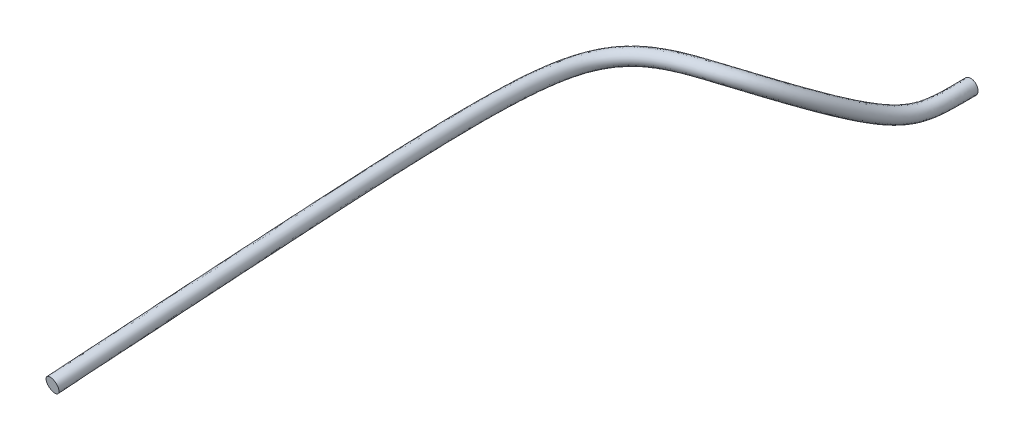
ISO-10303-21;
HEADER;
FILE_DESCRIPTION(('STEP AP214'),'2;1');
FILE_NAME('part.step','',(''),(''),'','','');
FILE_SCHEMA(('AUTOMOTIVE_DESIGN { 1 0 10303 214 1 1 1 1 }'));
ENDSEC;
DATA;
#1=APPLICATION_CONTEXT('core data for automotive mechanical design processes');
#2=APPLICATION_PROTOCOL_DEFINITION('international standard','automotive_design',2000,#1);
#3=PRODUCT_CONTEXT('',#1,'mechanical');
#4=PRODUCT('Part','Part','',(#3));
#5=PRODUCT_RELATED_PRODUCT_CATEGORY('part','',(#4));
#6=PRODUCT_DEFINITION_FORMATION('','',#4);
#7=PRODUCT_DEFINITION_CONTEXT('part definition',#1,'design');
#8=PRODUCT_DEFINITION('design','',#6,#7);
#9=PRODUCT_DEFINITION_SHAPE('','',#8);
#10=(LENGTH_UNIT() NAMED_UNIT(*) SI_UNIT(.MILLI.,.METRE.));
#11=(NAMED_UNIT(*) PLANE_ANGLE_UNIT() SI_UNIT($,.RADIAN.));
#12=(NAMED_UNIT(*) SI_UNIT($,.STERADIAN.) SOLID_ANGLE_UNIT());
#13=UNCERTAINTY_MEASURE_WITH_UNIT(LENGTH_MEASURE(1.E-05),#10,'distance_accuracy_value','');
#14=(GEOMETRIC_REPRESENTATION_CONTEXT(3) GLOBAL_UNCERTAINTY_ASSIGNED_CONTEXT((#13)) GLOBAL_UNIT_ASSIGNED_CONTEXT((#10,
#11,#12)) REPRESENTATION_CONTEXT('',''));
#15=CARTESIAN_POINT('',(0.,0.,0.));
#16=DIRECTION('',(0.,0.,1.));
#17=DIRECTION('',(1.,0.,0.));
#18=AXIS2_PLACEMENT_3D('',#15,#16,#17);
#19=CARTESIAN_POINT('',(0.,0.,0.));
#20=DIRECTION('',(0.,0.,1.));
#21=DIRECTION('',(1.,0.,0.));
#22=AXIS2_PLACEMENT_3D('',#19,#20,#21);
#23=PLANE('',#22);
#24=CARTESIAN_POINT('',(0.,0.,0.));
#25=DIRECTION('',(0.,0.,1.));
#26=DIRECTION('',(1.,0.,0.));
#27=AXIS2_PLACEMENT_3D('',#24,#25,#26);
#28=CIRCLE('',#27,1.15);
#29=CARTESIAN_POINT('',(1.15,0.,0.));
#30=VERTEX_POINT('',#29);
#31=EDGE_CURVE('E40',#30,#30,#28,.T.);
#32=ORIENTED_EDGE('',*,*,#31,.F.);
#33=EDGE_LOOP('',(#32));
#34=FACE_BOUND('',#33,.T.);
#35=ADVANCED_FACE('F33',(#34),#23,.F.);
#36=CARTESIAN_POINT('',(-31.9988546699459,-0.115057870125923,113.901531639743));
#37=DIRECTION('',(-0.116187071582963,-0.188366381532385,0.975201861516564));
#38=DIRECTION('',(0.882578906659321,0.430783948462864,0.188360460996416));
#39=AXIS2_PLACEMENT_3D('',#36,#37,#38);
#40=PLANE('',#39);
#41=CARTESIAN_POINT('',(-31.9988546699459,-0.115057870125923,113.901531639743));
#42=DIRECTION('',(-0.116187071582963,-0.188366381532385,0.975201861516564));
#43=DIRECTION('',(0.882578906659321,0.430783948462864,0.188360460996416));
#44=AXIS2_PLACEMENT_3D('',#41,#42,#43);
#45=CIRCLE('',#44,1.15);
#46=CARTESIAN_POINT('',(-30.9838889272877,0.380343670606371,114.118146169889));
#47=VERTEX_POINT('',#46);
#48=EDGE_CURVE('E11',#47,#47,#45,.T.);
#49=ORIENTED_EDGE('',*,*,#48,.T.);
#50=EDGE_LOOP('',(#49));
#51=FACE_BOUND('',#50,.T.);
#52=ADVANCED_FACE('F47',(#51),#40,.T.);
#53=CARTESIAN_POINT('',(1.15,0.,0.));
#54=CARTESIAN_POINT('',(1.15000000038601,-2.13450483906938E-09,1.40411667395807));
#55=CARTESIAN_POINT('',(1.12163524752858,-0.0455836005803812,2.60482889908168));
#56=CARTESIAN_POINT('',(0.986712418979958,-0.113027990204314,4.78907536466526));
#57=CARTESIAN_POINT('',(0.879728619676994,-0.134648475537359,5.7730653348689));
#58=CARTESIAN_POINT('',(0.568027062855145,-0.0331756014267641,7.69206339895828));
#59=CARTESIAN_POINT('',(0.363677743166363,0.0904033964046519,8.62505191253891));
#60=CARTESIAN_POINT('',(-0.152012278636615,0.590608892697884,10.6057794772086));
#61=CARTESIAN_POINT('',(-0.463093220859393,0.966286046148688,11.6542177741515));
#62=CARTESIAN_POINT('',(-1.23067961718823,2.10810592887332,14.1307295042907));
#63=CARTESIAN_POINT('',(-1.70106778904385,2.90554702535931,15.5986453352897));
#64=CARTESIAN_POINT('',(-2.87977037735416,4.65910869199436,18.6634669361827));
#65=CARTESIAN_POINT('',(-3.58782366157497,5.61542282336658,20.2611964574223));
#66=CARTESIAN_POINT('',(-5.34397098013944,7.42814134988539,23.341725362619));
#67=CARTESIAN_POINT('',(-6.39135817160007,8.28592389525016,24.826096657326));
#68=CARTESIAN_POINT('',(-8.96395449019275,9.62991514462926,27.4300799785647));
#69=CARTESIAN_POINT('',(-10.4988908724992,10.116532799519,28.5531699516577));
#70=CARTESIAN_POINT('',(-13.4859288705706,10.3293225152492,29.8086869101349));
#71=CARTESIAN_POINT('',(-14.7038374575679,10.2647728885911,30.1301939321772));
#72=CARTESIAN_POINT('',(-17.1080159363378,9.98807206024214,30.6946383333805));
#73=CARTESIAN_POINT('',(-18.2972584427251,9.77482488645506,30.9371166704468));
#74=CARTESIAN_POINT('',(-20.5116837808707,9.31698374742247,31.5411573325904));
#75=CARTESIAN_POINT('',(-21.5337661848834,9.07308699833395,31.9030588566672));
#76=CARTESIAN_POINT('',(-23.2756001008974,8.6585260336751,32.8855085253722));
#77=CARTESIAN_POINT('',(-23.9936903641095,8.48767638839588,33.4939028373493));
#78=CARTESIAN_POINT('',(-25.0599004134921,8.2899836962635,35.0634181827539));
#79=CARTESIAN_POINT('',(-25.4693113590438,8.24422196176755,36.0223406291999));
#80=CARTESIAN_POINT('',(-26.1185893059203,8.20545707272597,38.5179378443045));
#81=CARTESIAN_POINT('',(-26.3560213637961,8.21222116051957,40.0475269213535));
#82=CARTESIAN_POINT('',(-26.8751396639413,8.21775674957013,45.5430804921333));
#83=CARTESIAN_POINT('',(-26.9657264633824,8.20028290662248,50.408839272597));
#84=CARTESIAN_POINT('',(-27.3729455839668,7.27188284521443,69.3238046121954));
#85=CARTESIAN_POINT('',(-27.8360372497974,5.48374650240939,87.6970411872361));
#86=CARTESIAN_POINT('',(-30.9838889272877,0.380343670606371,114.118146169889));
#87=CARTESIAN_POINT('',(1.15,2.3,0.));
#88=CARTESIAN_POINT('',(1.15000000030546,2.29999999774325,1.45368024150767));
#89=CARTESIAN_POINT('',(1.11987976196573,2.25294228848605,2.68805822045673));
#90=CARTESIAN_POINT('',(0.986420047690538,2.18625649869582,4.84774577741702));
#91=CARTESIAN_POINT('',(0.883576622576509,2.16820796010899,5.76853067253322));
#92=CARTESIAN_POINT('',(0.608428063087534,2.25772458245462,7.46113650123156));
#93=CARTESIAN_POINT('',(0.437977823083596,2.36118671279866,8.23531581140845));
#94=CARTESIAN_POINT('',(-0.00211678953055316,2.78803495884321,9.92554302700057));
#95=CARTESIAN_POINT('',(-0.274570393020001,3.11422663306356,10.8463970004701));
#96=CARTESIAN_POINT('',(-0.981777659885264,4.16622996929226,13.1281041987432));
#97=CARTESIAN_POINT('',(-1.43935903607286,4.9412945142335,14.5605225115562));
#98=CARTESIAN_POINT('',(-2.60448621627325,6.67468788250677,17.5900995877514));
#99=CARTESIAN_POINT('',(-3.31280242729696,7.633746817924,19.1927513443077));
#100=CARTESIAN_POINT('',(-5.09452633691307,9.47290804351192,22.3182264987289));
#101=CARTESIAN_POINT('',(-6.16660839375214,10.3557010299729,23.8444193667923));
#102=CARTESIAN_POINT('',(-8.85853032191823,11.7620429033973,26.5692100020356));
#103=CARTESIAN_POINT('',(-10.4960041206883,12.2868118934972,27.7747524637937));
#104=CARTESIAN_POINT('',(-13.7263126211921,12.5169317982091,29.1325217252641));
#105=CARTESIAN_POINT('',(-15.0291921096376,12.4467992383082,29.4753662131319));
#106=CARTESIAN_POINT('',(-17.5818598469435,12.1531165581351,30.0750027523357));
#107=CARTESIAN_POINT('',(-18.8365245732711,11.9279707551851,30.3307422044092));
#108=CARTESIAN_POINT('',(-21.1783321220974,11.4438681481626,30.9697749564959));
#109=CARTESIAN_POINT('',(-22.2633808943536,11.1850345188788,31.3531808838988));
#110=CARTESIAN_POINT('',(-24.126103982831,10.7417290484125,32.4039131715725));
#111=CARTESIAN_POINT('',(-24.90066171508,10.5576505789655,33.0619584960508));
#112=CARTESIAN_POINT('',(-26.0328779783983,10.3477192214095,34.7286381493729));
#113=CARTESIAN_POINT('',(-26.4640061256414,10.2997468696394,35.7431113796272));
#114=CARTESIAN_POINT('',(-27.1388293817799,10.2594456844529,38.3368017901375));
#115=CARTESIAN_POINT('',(-27.3819316656735,10.266508768431,39.9101502164698));
#116=CARTESIAN_POINT('',(-27.9118640086,10.2721453858816,45.5198965613145));
#117=CARTESIAN_POINT('',(-28.0021915647737,10.2537706671499,50.4412096727091));
#118=CARTESIAN_POINT('',(-28.4123804129625,9.31860072919853,69.4940986726683));
#119=CARTESIAN_POINT('',(-28.8788370977383,7.52184439971334,87.9219997042581));
#120=CARTESIAN_POINT('',(-32.0317277271901,2.41027224967798,114.385398509986));
#121=CARTESIAN_POINT('',(-1.15,2.3,0.));
#122=CARTESIAN_POINT('',(-1.14999999976228,2.29999999763094,1.42258713504903));
#123=CARTESIAN_POINT('',(-1.17970589648002,2.25434102356367,2.61042186531614));
#124=CARTESIAN_POINT('',(-1.30525120934955,2.19155921748981,4.64198307377375));
#125=CARTESIAN_POINT('',(-1.39974312497445,2.17553530030015,5.48027338419586));
#126=CARTESIAN_POINT('',(-1.6486922784187,2.25631467082705,7.01158027537886));
#127=CARTESIAN_POINT('',(-1.80203149315792,2.34804362400613,7.71099434866211));
#128=CARTESIAN_POINT('',(-2.21656341809784,2.7500607545698,9.30303875838792));
#129=CARTESIAN_POINT('',(-2.48108487472946,3.06505316070779,10.1990766371529));
#130=CARTESIAN_POINT('',(-3.18152342451672,4.10698784776783,12.458945492119));
#131=CARTESIAN_POINT('',(-3.62705355978731,4.86170684108259,13.8514651436541));
#132=CARTESIAN_POINT('',(-4.74693643370806,6.52781002079589,16.7633965960215));
#133=CARTESIAN_POINT('',(-5.42258183838367,7.43953721226092,18.2866539015238));
#134=CARTESIAN_POINT('',(-7.07988969663745,9.15031377610454,21.1938758521855));
#135=CARTESIAN_POINT('',(-8.06164018903877,9.9492975607313,22.5780661619679));
#136=CARTESIAN_POINT('',(-10.4045585759612,11.1733275603611,24.9495894913944));
#137=CARTESIAN_POINT('',(-11.7639058857457,11.5987759903035,25.9369113233506));
#138=CARTESIAN_POINT('',(-14.3753118205452,11.7848070527038,27.034542263));
#139=CARTESIAN_POINT('',(-15.5233210022874,11.7311522374743,27.3448416877877));
#140=CARTESIAN_POINT('',(-17.9332170813006,11.454221283658,27.9108534413569));
#141=CARTESIAN_POINT('',(-19.1940352466503,11.2315413926317,28.1664312271909));
#142=CARTESIAN_POINT('',(-21.695012914061,10.7147866916185,28.8487961901196));
#143=CARTESIAN_POINT('',(-22.9392792432824,10.4194406078466,29.2750175652025));
#144=CARTESIAN_POINT('',(-25.2588954498099,9.8674970697488,30.5834084867944));
#145=CARTESIAN_POINT('',(-26.3344512604499,9.61166383212488,31.4806046311639));
#146=CARTESIAN_POINT('',(-27.8876377421588,9.32367760513961,33.7669739296408));
#147=CARTESIAN_POINT('',(-28.4039954454789,9.26958999665599,35.0381210714887));
#148=CARTESIAN_POINT('',(-29.1685865027609,9.22390294809337,37.9768985263314));
#149=CARTESIAN_POINT('',(-29.4210969120536,9.23216094661085,39.6528314587336));
#150=CARTESIAN_POINT('',(-29.9694797193934,9.23796673080044,45.4580488007992));
#151=CARTESIAN_POINT('',(-30.0549188251068,9.21812804136961,50.3739499725997));
#152=CARTESIAN_POINT('',(-30.4633193269557,8.28703445995778,69.3437807201011));
#153=CARTESIAN_POINT('',(-30.9237518635325,6.50674992121863,87.6145309589596));
#154=CARTESIAN_POINT('',(-34.0616592125065,1.4194691682134,113.952169449695));
#155=CARTESIAN_POINT('',(-1.15,0.,0.));
#156=CARTESIAN_POINT('',(-1.14999999968174,-2.24681575311621E-09,1.37302356749943));
#157=CARTESIAN_POINT('',(-1.17795041091717,-0.0441848655027606,2.52719254394097));
#158=CARTESIAN_POINT('',(-1.30495883806013,-0.107725271410329,4.5833126610221));
#159=CARTESIAN_POINT('',(-1.40359112787397,-0.127321135346196,5.48480804653155));
#160=CARTESIAN_POINT('',(-1.68909327865109,-0.0345855130543298,7.24250717310558));
#161=CARTESIAN_POINT('',(-1.87633157307504,0.0772603076121273,8.10073044979258));
#162=CARTESIAN_POINT('',(-2.36645890720402,0.552634688424476,9.98327520859595));
#163=CARTESIAN_POINT('',(-2.66960770256885,0.917112573792918,11.0068974108343));
#164=CARTESIAN_POINT('',(-3.43042538181969,2.04886380734889,13.4615707976665));
#165=CARTESIAN_POINT('',(-3.8887623127581,2.82595935220841,14.8895879673877));
#166=CARTESIAN_POINT('',(-5.02222059478917,4.51223083028349,17.8367639444527));
#167=CARTESIAN_POINT('',(-5.69760307266126,5.4212132177035,19.3550990146384));
#168=CARTESIAN_POINT('',(-7.32933433986423,7.105547082478,22.2173747160756));
#169=CARTESIAN_POINT('',(-8.2863899668867,7.87952042600776,23.5597434525015));
#170=CARTESIAN_POINT('',(-10.5099827442357,9.04119980159387,25.8104594679235));
#171=CARTESIAN_POINT('',(-11.7667926375566,9.42849689632489,26.7153288112146));
#172=CARTESIAN_POINT('',(-14.1349280699237,9.59719776974419,27.7107074478708));
#173=CARTESIAN_POINT('',(-15.1979663502177,9.54912588775689,27.999669406833));
#174=CARTESIAN_POINT('',(-17.4593731706948,9.28917678576533,28.5304890224018));
#175=CARTESIAN_POINT('',(-18.6547691161043,9.07839552390139,28.7728056932284));
#176=CARTESIAN_POINT('',(-21.0283645728343,8.5879022908787,29.4201785662141));
#177=CARTESIAN_POINT('',(-22.2096645338132,8.3074930873013,29.8248955379709));
#178=CARTESIAN_POINT('',(-24.4083915678753,7.78429405501193,31.0650038405941));
#179=CARTESIAN_POINT('',(-25.4274799094794,7.54168964155526,31.9125489724624));
#180=CARTESIAN_POINT('',(-26.9146601772527,7.26594207999361,34.1017539630218));
#181=CARTESIAN_POINT('',(-27.4093006788813,7.21406508878416,35.317350321059));
#182=CARTESIAN_POINT('',(-28.1483464269014,7.16991433636647,38.1580345805007));
#183=CARTESIAN_POINT('',(-28.3951866101762,7.17787333869983,39.7902081636173));
#184=CARTESIAN_POINT('',(-28.9327553747348,7.18357809448817,45.4812327316181));
#185=CARTESIAN_POINT('',(-29.0184537237155,7.16464028084216,50.3415795724876));
#186=CARTESIAN_POINT('',(-29.4238844979599,6.24031657597368,69.1734866596282));
#187=CARTESIAN_POINT('',(-29.8809520155213,4.46865202391176,87.3895724419376));
#188=CARTESIAN_POINT('',(-33.0138204126041,-0.610459410858216,113.684917109598));
#189=CARTESIAN_POINT('',(-1.15,-2.3,0.));
#190=CARTESIAN_POINT('',(-1.1499999996012,-2.30000000212457,1.32345999994982));
#191=CARTESIAN_POINT('',(-1.17619492535432,-2.34271075456919,2.44396322256579));
#192=CARTESIAN_POINT('',(-1.30466646677071,-2.40700976031047,4.52464224827045));
#193=CARTESIAN_POINT('',(-1.40743913077348,-2.43017757099254,5.48934270886723));
#194=CARTESIAN_POINT('',(-1.72949427888348,-2.32548569693571,7.4734340708323));
#195=CARTESIAN_POINT('',(-1.95063165299217,-2.19352300878188,8.49046655092304));
#196=CARTESIAN_POINT('',(-2.51635439631019,-1.64479137772085,10.663511658804));
#197=CARTESIAN_POINT('',(-2.85813053040824,-1.23082801312195,11.8147181845157));
#198=CARTESIAN_POINT('',(-3.67932733912265,-0.00926023307004371,14.464196103214));
#199=CARTESIAN_POINT('',(-4.1504710657289,0.79021186333422,15.9277107911212));
#200=CARTESIAN_POINT('',(-5.29750475587028,2.49665163977109,18.9101312928839));
#201=CARTESIAN_POINT('',(-5.97262430693885,3.40288922314608,20.423544127753));
#202=CARTESIAN_POINT('',(-7.57877898309101,5.06078038885147,23.2408735799658));
#203=CARTESIAN_POINT('',(-8.51113974473463,5.80974329128423,24.5414207430351));
#204=CARTESIAN_POINT('',(-10.6154069125102,6.90907204282665,26.6713294444526));
#205=CARTESIAN_POINT('',(-11.7696793893675,7.25821780234626,27.4937462990786));
#206=CARTESIAN_POINT('',(-13.8945443193022,7.40958848678453,28.3868726327416));
#207=CARTESIAN_POINT('',(-14.8726116981481,7.36709953803954,28.6544971258783));
#208=CARTESIAN_POINT('',(-16.9855292600891,7.12413228787265,29.1501246034466));
#209=CARTESIAN_POINT('',(-18.1155029855582,6.92524965517112,29.379180159266));
#210=CARTESIAN_POINT('',(-20.3617162316076,6.46101789013887,29.9915609423086));
#211=CARTESIAN_POINT('',(-21.4800498243439,6.19554556675598,30.3747735107393));
#212=CARTESIAN_POINT('',(-23.5578876859408,5.70109104027506,31.5465991943939));
#213=CARTESIAN_POINT('',(-24.5205085585089,5.47171545098563,32.344493313761));
#214=CARTESIAN_POINT('',(-25.9416826123465,5.20820655484762,34.4365339964028));
#215=CARTESIAN_POINT('',(-26.4146059122836,5.15854018091233,35.5965795706293));
#216=CARTESIAN_POINT('',(-27.1281063510418,5.11592572463957,38.33917063467));
#217=CARTESIAN_POINT('',(-27.3692763082988,5.12358573078881,39.9275848685009));
#218=CARTESIAN_POINT('',(-27.8960310300761,5.1291894581759,45.504416662437));
#219=CARTESIAN_POINT('',(-27.9819886223242,5.11115252031472,50.3092091723756));
#220=CARTESIAN_POINT('',(-28.3844496689642,4.19359869198958,69.0031925991553));
#221=CARTESIAN_POINT('',(-28.83815216751,2.43055412660488,87.1646139249157));
#222=CARTESIAN_POINT('',(-31.9659816127017,-2.64038798992983,113.417664769501));
#223=CARTESIAN_POINT('',(1.15,-2.3,0.));
#224=CARTESIAN_POINT('',(1.15000000046655,-2.30000000201226,1.35455310640847));
#225=CARTESIAN_POINT('',(1.12339073309142,-2.34410948964681,2.52159957770662));
#226=CARTESIAN_POINT('',(0.987004790269378,-2.41231247910445,4.73040495191349));
#227=CARTESIAN_POINT('',(0.875880616777478,-2.4375049111837,5.77759999720459));
#228=CARTESIAN_POINT('',(0.527626062622756,-2.32407578530815,7.92299029668499));
#229=CARTESIAN_POINT('',(0.28937766324913,-2.18037991998935,9.01478801366938));
#230=CARTESIAN_POINT('',(-0.301907767742677,-1.60681717344744,11.2860159274166));
#231=CARTESIAN_POINT('',(-0.651616048698785,-1.18165454076618,12.4620385478329));
#232=CARTESIAN_POINT('',(-1.4795815744912,0.0499818884543864,15.1333548098382));
#233=CARTESIAN_POINT('',(-1.96277654201484,0.869799536485127,16.6367681590233));
#234=CARTESIAN_POINT('',(-3.15505453843507,2.64352950148196,19.7368342846139));
#235=CARTESIAN_POINT('',(-3.86284489585297,3.59709882880916,21.3296415705369));
#236=CARTESIAN_POINT('',(-5.5934156233658,5.38337465625885,24.3652242265092));
#237=CARTESIAN_POINT('',(-6.616107949448,6.21614676052742,25.8077739478596));
#238=CARTESIAN_POINT('',(-9.06937865846727,7.49778738586125,28.2909499550939));
#239=CARTESIAN_POINT('',(-10.5017776243101,7.94625370554071,29.3315874395217));
#240=CARTESIAN_POINT('',(-13.2455451199491,8.14171323228929,30.4848520950057));
#241=CARTESIAN_POINT('',(-14.3784828054983,8.08274653887403,30.7850216512225));
#242=CARTESIAN_POINT('',(-16.634172025732,7.8230275623492,31.3142739144254));
#243=CARTESIAN_POINT('',(-17.7579923121791,7.62167901772506,31.5434911364844));
#244=CARTESIAN_POINT('',(-19.845035439644,7.19009934668239,32.1125397086849));
#245=CARTESIAN_POINT('',(-20.8041514754131,6.96113947778913,32.4529368294357));
#246=CARTESIAN_POINT('',(-22.4250962189639,6.57532301893773,33.367103879172));
#247=CARTESIAN_POINT('',(-23.086719013139,6.41770219782626,33.9258471786479));
#248=CARTESIAN_POINT('',(-24.086922848586,6.23224817111751,35.3981982161348));
#249=CARTESIAN_POINT('',(-24.4746165924461,6.18869705389573,36.3015698787726));
#250=CARTESIAN_POINT('',(-25.0983492300608,6.15146846099907,38.6990738984714));
#251=CARTESIAN_POINT('',(-25.3301110619188,6.15793355260815,40.1849036262371));
#252=CARTESIAN_POINT('',(-25.8384153192827,6.16336811325867,45.5662644229522));
#253=CARTESIAN_POINT('',(-25.929261361991,6.14679514609503,50.3764688724849));
#254=CARTESIAN_POINT('',(-26.3335107549711,5.22516496123034,69.1535105517225));
#255=CARTESIAN_POINT('',(-26.7932374018566,3.44564860510545,87.4720826702142));
#256=CARTESIAN_POINT('',(-29.9360501273852,-1.64958490846524,113.850893829792));
#257=CARTESIAN_POINT('',(1.15,0.,0.));
#258=CARTESIAN_POINT('',(1.15000000038601,-2.13450483906938E-09,1.40411667395807));
#259=CARTESIAN_POINT('',(1.12163524752858,-0.0455836005803812,2.60482889908168));
#260=CARTESIAN_POINT('',(0.986712418979958,-0.113027990204314,4.78907536466526));
#261=CARTESIAN_POINT('',(0.879728619676994,-0.134648475537359,5.7730653348689));
#262=CARTESIAN_POINT('',(0.568027062855145,-0.0331756014267641,7.69206339895828));
#263=CARTESIAN_POINT('',(0.363677743166363,0.0904033964046519,8.62505191253891));
#264=CARTESIAN_POINT('',(-0.152012278636615,0.590608892697884,10.6057794772086));
#265=CARTESIAN_POINT('',(-0.463093220859393,0.966286046148688,11.6542177741515));
#266=CARTESIAN_POINT('',(-1.23067961718823,2.10810592887332,14.1307295042907));
#267=CARTESIAN_POINT('',(-1.70106778904385,2.90554702535931,15.5986453352897));
#268=CARTESIAN_POINT('',(-2.87977037735416,4.65910869199436,18.6634669361827));
#269=CARTESIAN_POINT('',(-3.58782366157497,5.61542282336658,20.2611964574223));
#270=CARTESIAN_POINT('',(-5.34397098013944,7.42814134988539,23.341725362619));
#271=CARTESIAN_POINT('',(-6.39135817160007,8.28592389525016,24.826096657326));
#272=CARTESIAN_POINT('',(-8.96395449019275,9.62991514462926,27.4300799785647));
#273=CARTESIAN_POINT('',(-10.4988908724992,10.116532799519,28.5531699516577));
#274=CARTESIAN_POINT('',(-13.4859288705706,10.3293225152492,29.8086869101349));
#275=CARTESIAN_POINT('',(-14.7038374575679,10.2647728885911,30.1301939321772));
#276=CARTESIAN_POINT('',(-17.1080159363378,9.98807206024214,30.6946383333805));
#277=CARTESIAN_POINT('',(-18.2972584427251,9.77482488645506,30.9371166704468));
#278=CARTESIAN_POINT('',(-20.5116837808707,9.31698374742247,31.5411573325904));
#279=CARTESIAN_POINT('',(-21.5337661848834,9.07308699833395,31.9030588566672));
#280=CARTESIAN_POINT('',(-23.2756001008974,8.6585260336751,32.8855085253722));
#281=CARTESIAN_POINT('',(-23.9936903641095,8.48767638839588,33.4939028373493));
#282=CARTESIAN_POINT('',(-25.0599004134921,8.2899836962635,35.0634181827539));
#283=CARTESIAN_POINT('',(-25.4693113590438,8.24422196176755,36.0223406291999));
#284=CARTESIAN_POINT('',(-26.1185893059203,8.20545707272597,38.5179378443045));
#285=CARTESIAN_POINT('',(-26.3560213637961,8.21222116051957,40.0475269213535));
#286=CARTESIAN_POINT('',(-26.8751396639413,8.21775674957013,45.5430804921333));
#287=CARTESIAN_POINT('',(-26.9657264633824,8.20028290662248,50.408839272597));
#288=CARTESIAN_POINT('',(-27.3729455839668,7.27188284521443,69.3238046121954));
#289=CARTESIAN_POINT('',(-27.8360372497974,5.48374650240939,87.6970411872361));
#290=CARTESIAN_POINT('',(-30.9838889272877,0.380343670606371,114.118146169889));
#291=(BOUNDED_SURFACE() B_SPLINE_SURFACE(3,3,((#53,#54,#55,#56,#57,#58,#59,#60,#61,#62,#63,#64,
#65,#66,#67,#68,#69,#70,#71,#72,#73,#74,#75,#76,#77,#78,#79,#80,#81,#82,#83,#84,#85,#86),(#87,
#88,#89,#90,#91,#92,#93,#94,#95,#96,#97,#98,#99,#100,#101,#102,#103,#104,#105,#106,#107,#108,
#109,#110,#111,#112,#113,#114,#115,#116,#117,#118,#119,#120),(#121,#122,#123,#124,#125,#126,
#127,#128,#129,#130,#131,#132,#133,#134,#135,#136,#137,#138,#139,#140,#141,#142,#143,#144,#145,
#146,#147,#148,#149,#150,#151,#152,#153,#154),(#155,#156,#157,#158,#159,#160,#161,#162,#163,
#164,#165,#166,#167,#168,#169,#170,#171,#172,#173,#174,#175,#176,#177,#178,#179,#180,#181,#182,
#183,#184,#185,#186,#187,#188),(#189,#190,#191,#192,#193,#194,#195,#196,#197,#198,#199,#200,
#201,#202,#203,#204,#205,#206,#207,#208,#209,#210,#211,#212,#213,#214,#215,#216,#217,#218,#219,
#220,#221,#222),(#223,#224,#225,#226,#227,#228,#229,#230,#231,#232,#233,#234,#235,#236,#237,
#238,#239,#240,#241,#242,#243,#244,#245,#246,#247,#248,#249,#250,#251,#252,#253,#254,#255,#256),
(#257,#258,#259,#260,#261,#262,#263,#264,#265,#266,#267,#268,#269,#270,#271,#272,#273,#274,#275,
#276,#277,#278,#279,#280,#281,#282,#283,#284,#285,#286,#287,#288,#289,#290)),.UNSPECIFIED.,.T.,
.F.,.F.) B_SPLINE_SURFACE_WITH_KNOTS((4,3,4),(4,2,2,2,2,2,2,2,2,2,2,2,2,2,2,2,4),(0.,0.5,1.),
(0.,0.0639961778010472,0.127992355602094,0.191988533403142,0.255984711204189,0.323476430323547,
0.390968149442906,0.458459868562264,0.525951587681623,0.569038039796595,0.612124491911568,
0.65521094402654,0.698297396141513,0.736010221623824,0.773723047106135,0.849148698070757,1.),
.UNSPECIFIED.) GEOMETRIC_REPRESENTATION_ITEM() RATIONAL_B_SPLINE_SURFACE(((1.,1.,1.,1.,1.,1.,1.,
1.,1.,1.,1.,1.,1.,1.,1.,1.,1.,1.,1.,1.,1.,1.,1.,1.,1.,1.,1.,1.,1.,1.,1.,1.,1.,1.),
(0.333333333333333,0.333333333333333,0.333333333333333,0.333333333333333,0.333333333333333,
0.333333333333333,0.333333333333333,0.333333333333333,0.333333333333333,0.333333333333333,
0.333333333333333,0.333333333333333,0.333333333333333,0.333333333333333,0.333333333333333,
0.333333333333333,0.333333333333333,0.333333333333333,0.333333333333333,0.333333333333333,
0.333333333333333,0.333333333333333,0.333333333333333,0.333333333333333,0.333333333333333,
0.333333333333333,0.333333333333333,0.333333333333333,0.333333333333333,0.333333333333333,
0.333333333333333,0.333333333333333,0.333333333333333,0.333333333333333),(0.333333333333333,
0.333333333333333,0.333333333333333,0.333333333333333,0.333333333333333,0.333333333333333,
0.333333333333333,0.333333333333333,0.333333333333333,0.333333333333333,0.333333333333333,
0.333333333333333,0.333333333333333,0.333333333333333,0.333333333333333,0.333333333333333,
0.333333333333333,0.333333333333333,0.333333333333333,0.333333333333333,0.333333333333333,
0.333333333333333,0.333333333333333,0.333333333333333,0.333333333333333,0.333333333333333,
0.333333333333333,0.333333333333333,0.333333333333333,0.333333333333333,0.333333333333333,
0.333333333333333,0.333333333333333,0.333333333333333),(1.,1.,1.,1.,1.,1.,1.,1.,1.,1.,1.,1.,1.,
1.,1.,1.,1.,1.,1.,1.,1.,1.,1.,1.,1.,1.,1.,1.,1.,1.,1.,1.,1.,1.),(0.333333333333333,
0.333333333333333,0.333333333333333,0.333333333333333,0.333333333333333,0.333333333333333,
0.333333333333333,0.333333333333333,0.333333333333333,0.333333333333333,0.333333333333333,
0.333333333333333,0.333333333333333,0.333333333333333,0.333333333333333,0.333333333333333,
0.333333333333333,0.333333333333333,0.333333333333333,0.333333333333333,0.333333333333333,
0.333333333333333,0.333333333333333,0.333333333333333,0.333333333333333,0.333333333333333,
0.333333333333333,0.333333333333333,0.333333333333333,0.333333333333333,0.333333333333333,
0.333333333333333,0.333333333333333,0.333333333333333),(0.333333333333333,0.333333333333333,
0.333333333333333,0.333333333333333,0.333333333333333,0.333333333333333,0.333333333333333,
0.333333333333333,0.333333333333333,0.333333333333333,0.333333333333333,0.333333333333333,
0.333333333333333,0.333333333333333,0.333333333333333,0.333333333333333,0.333333333333333,
0.333333333333333,0.333333333333333,0.333333333333333,0.333333333333333,0.333333333333333,
0.333333333333333,0.333333333333333,0.333333333333333,0.333333333333333,0.333333333333333,
0.333333333333333,0.333333333333333,0.333333333333333,0.333333333333333,0.333333333333333,
0.333333333333333,0.333333333333333),(1.,1.,1.,1.,1.,1.,1.,1.,1.,1.,1.,1.,1.,1.,1.,1.,1.,1.,1.,
1.,1.,1.,1.,1.,1.,1.,1.,1.,1.,1.,1.,1.,1.,1.))) REPRESENTATION_ITEM('') SURFACE());
#292=ORIENTED_EDGE('',*,*,#48,.F.);
#293=EDGE_LOOP('',(#292));
#294=FACE_BOUND('',#293,.T.);
#295=ORIENTED_EDGE('',*,*,#31,.T.);
#296=EDGE_LOOP('',(#295));
#297=FACE_BOUND('',#296,.T.);
#298=ADVANCED_FACE('F49',(#294,#297),#291,.T.);
#299=CLOSED_SHELL('',(#35,#52,#298));
#300=MANIFOLD_SOLID_BREP('B2',#299);
#301=ADVANCED_BREP_SHAPE_REPRESENTATION('',(#18,#300),#14);
#302=SHAPE_DEFINITION_REPRESENTATION(#9,#301);
ENDSEC;
END-ISO-10303-21;
